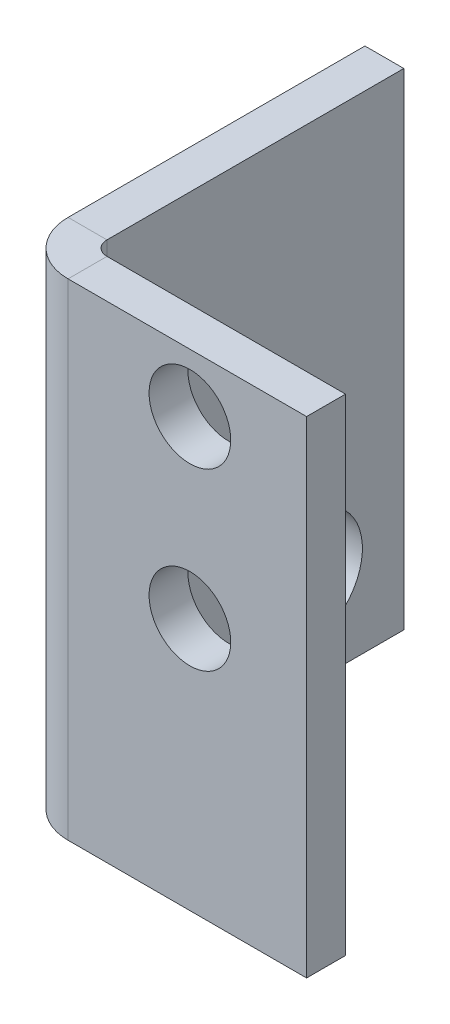
ISO-10303-21;
HEADER;
FILE_DESCRIPTION(('STEP AP214'),'2;1');
FILE_NAME('part.step','',(''),(''),'','','');
FILE_SCHEMA(('AUTOMOTIVE_DESIGN { 1 0 10303 214 1 1 1 1 }'));
ENDSEC;
DATA;
#1=APPLICATION_CONTEXT('core data for automotive mechanical design processes');
#2=APPLICATION_PROTOCOL_DEFINITION('international standard','automotive_design',2000,#1);
#3=PRODUCT_CONTEXT('',#1,'mechanical');
#4=PRODUCT('Part','Part','',(#3));
#5=PRODUCT_RELATED_PRODUCT_CATEGORY('part','',(#4));
#6=PRODUCT_DEFINITION_FORMATION('','',#4);
#7=PRODUCT_DEFINITION_CONTEXT('part definition',#1,'design');
#8=PRODUCT_DEFINITION('design','',#6,#7);
#9=PRODUCT_DEFINITION_SHAPE('','',#8);
#10=(LENGTH_UNIT() NAMED_UNIT(*) SI_UNIT(.MILLI.,.METRE.));
#11=(NAMED_UNIT(*) PLANE_ANGLE_UNIT() SI_UNIT($,.RADIAN.));
#12=(NAMED_UNIT(*) SI_UNIT($,.STERADIAN.) SOLID_ANGLE_UNIT());
#13=UNCERTAINTY_MEASURE_WITH_UNIT(LENGTH_MEASURE(1.E-05),#10,'distance_accuracy_value','');
#14=(GEOMETRIC_REPRESENTATION_CONTEXT(3) GLOBAL_UNCERTAINTY_ASSIGNED_CONTEXT((#13)) GLOBAL_UNIT_ASSIGNED_CONTEXT((#10,
#11,#12)) REPRESENTATION_CONTEXT('',''));
#15=CARTESIAN_POINT('',(0.,0.,0.));
#16=DIRECTION('',(0.,0.,1.));
#17=DIRECTION('',(1.,0.,0.));
#18=AXIS2_PLACEMENT_3D('',#15,#16,#17);
#19=CARTESIAN_POINT('',(2.,0.,22.));
#20=DIRECTION('',(-1.,0.,0.));
#21=DIRECTION('',(0.,0.,1.));
#22=AXIS2_PLACEMENT_3D('',#19,#20,#21);
#23=PLANE('',#22);
#24=CARTESIAN_POINT('',(2.,4.7,9.13));
#25=DIRECTION('',(-1.,0.,0.));
#26=DIRECTION('',(0.,0.,1.));
#27=AXIS2_PLACEMENT_3D('',#24,#25,#26);
#28=CIRCLE('',#27,3.);
#29=CARTESIAN_POINT('',(2.,4.7,12.13));
#30=VERTEX_POINT('',#29);
#31=EDGE_CURVE('E171',#30,#30,#28,.T.);
#32=ORIENTED_EDGE('',*,*,#31,.T.);
#33=EDGE_LOOP('',(#32));
#34=FACE_BOUND('',#33,.T.);
#35=DIRECTION('',(0.,-1.,0.));
#36=VECTOR('',#35,1.);
#37=CARTESIAN_POINT('',(2.,0.,4.));
#38=LINE('',#37,#36);
#39=CARTESIAN_POINT('',(2.,25.,4.));
#40=VERTEX_POINT('',#39);
#41=CARTESIAN_POINT('',(2.,0.,4.));
#42=VERTEX_POINT('',#41);
#43=EDGE_CURVE('E122',#40,#42,#38,.T.);
#44=ORIENTED_EDGE('',*,*,#43,.F.);
#45=DIRECTION('',(0.,0.,-1.));
#46=VECTOR('',#45,1.);
#47=CARTESIAN_POINT('',(2.,25.,22.));
#48=LINE('',#47,#46);
#49=CARTESIAN_POINT('',(2.,25.,19.2634));
#50=VERTEX_POINT('',#49);
#51=EDGE_CURVE('E65',#50,#40,#48,.T.);
#52=ORIENTED_EDGE('',*,*,#51,.F.);
#53=DIRECTION('',(0.,-1.,0.));
#54=VECTOR('',#53,1.);
#55=CARTESIAN_POINT('',(2.,0.,19.2634));
#56=LINE('',#55,#54);
#57=CARTESIAN_POINT('',(2.,0.,19.2634));
#58=VERTEX_POINT('',#57);
#59=EDGE_CURVE('E153',#58,#50,#56,.F.);
#60=ORIENTED_EDGE('',*,*,#59,.F.);
#61=DIRECTION('',(0.,0.,-1.));
#62=VECTOR('',#61,1.);
#63=CARTESIAN_POINT('',(2.,0.,22.));
#64=LINE('',#63,#62);
#65=EDGE_CURVE('E140',#58,#42,#64,.T.);
#66=ORIENTED_EDGE('',*,*,#65,.T.);
#67=EDGE_LOOP('',(#44,#52,#60,#66));
#68=FACE_BOUND('',#67,.T.);
#69=ADVANCED_FACE('F58',(#34,#68),#23,.F.);
#70=CARTESIAN_POINT('',(0.,0.,22.));
#71=DIRECTION('',(-1.,0.,0.));
#72=DIRECTION('',(0.,0.,1.));
#73=AXIS2_PLACEMENT_3D('',#70,#71,#72);
#74=PLANE('',#73);
#75=CARTESIAN_POINT('',(0.,4.7,9.13));
#76=DIRECTION('',(-1.,0.,0.));
#77=DIRECTION('',(0.,0.,1.));
#78=AXIS2_PLACEMENT_3D('',#75,#76,#77);
#79=CIRCLE('',#78,3.);
#80=CARTESIAN_POINT('',(0.,4.7,12.13));
#81=VERTEX_POINT('',#80);
#82=EDGE_CURVE('E168',#81,#81,#79,.T.);
#83=ORIENTED_EDGE('',*,*,#82,.F.);
#84=EDGE_LOOP('',(#83));
#85=FACE_BOUND('',#84,.T.);
#86=DIRECTION('',(0.,0.,-1.));
#87=VECTOR('',#86,1.);
#88=CARTESIAN_POINT('',(0.,25.,22.));
#89=LINE('',#88,#87);
#90=CARTESIAN_POINT('',(0.,25.,19.2634));
#91=VERTEX_POINT('',#90);
#92=CARTESIAN_POINT('',(0.,25.,4.));
#93=VERTEX_POINT('',#92);
#94=EDGE_CURVE('E135',#91,#93,#89,.T.);
#95=ORIENTED_EDGE('',*,*,#94,.T.);
#96=DIRECTION('',(0.,1.,0.));
#97=VECTOR('',#96,1.);
#98=CARTESIAN_POINT('',(0.,0.,4.));
#99=LINE('',#98,#97);
#100=CARTESIAN_POINT('',(0.,0.,4.));
#101=VERTEX_POINT('',#100);
#102=EDGE_CURVE('E72',#101,#93,#99,.T.);
#103=ORIENTED_EDGE('',*,*,#102,.F.);
#104=DIRECTION('',(0.,0.,-1.));
#105=VECTOR('',#104,1.);
#106=CARTESIAN_POINT('',(0.,0.,22.));
#107=LINE('',#106,#105);
#108=CARTESIAN_POINT('',(0.,0.,19.2634));
#109=VERTEX_POINT('',#108);
#110=EDGE_CURVE('E133',#109,#101,#107,.T.);
#111=ORIENTED_EDGE('',*,*,#110,.F.);
#112=DIRECTION('',(0.,-1.,0.));
#113=VECTOR('',#112,1.);
#114=CARTESIAN_POINT('',(0.,0.,19.2634));
#115=LINE('',#114,#113);
#116=EDGE_CURVE('E207',#109,#91,#115,.F.);
#117=ORIENTED_EDGE('',*,*,#116,.T.);
#118=EDGE_LOOP('',(#95,#103,#111,#117));
#119=FACE_BOUND('',#118,.T.);
#120=ADVANCED_FACE('F131',(#85,#119),#74,.T.);
#121=CARTESIAN_POINT('',(2.,0.,22.));
#122=DIRECTION('',(0.,-1.,0.));
#123=DIRECTION('',(0.,0.,-1.));
#124=AXIS2_PLACEMENT_3D('',#121,#122,#123);
#125=PLANE('',#124);
#126=ORIENTED_EDGE('',*,*,#110,.T.);
#127=DIRECTION('',(-1.,0.,0.));
#128=VECTOR('',#127,1.);
#129=CARTESIAN_POINT('',(0.,0.,4.));
#130=LINE('',#129,#128);
#131=EDGE_CURVE('E119',#42,#101,#130,.T.);
#132=ORIENTED_EDGE('',*,*,#131,.F.);
#133=ORIENTED_EDGE('',*,*,#65,.F.);
#134=DIRECTION('',(-1.,0.,0.));
#135=VECTOR('',#134,1.);
#136=CARTESIAN_POINT('',(2.,0.,19.2634));
#137=LINE('',#136,#135);
#138=EDGE_CURVE('E139',#58,#109,#137,.T.);
#139=ORIENTED_EDGE('',*,*,#138,.T.);
#140=EDGE_LOOP('',(#126,#132,#133,#139));
#141=FACE_BOUND('',#140,.T.);
#142=ADVANCED_FACE('F138',(#141),#125,.T.);
#143=CARTESIAN_POINT('',(0.,25.,22.));
#144=DIRECTION('',(0.,1.,0.));
#145=DIRECTION('',(0.,0.,1.));
#146=AXIS2_PLACEMENT_3D('',#143,#144,#145);
#147=PLANE('',#146);
#148=ORIENTED_EDGE('',*,*,#51,.T.);
#149=DIRECTION('',(-1.,0.,0.));
#150=VECTOR('',#149,1.);
#151=CARTESIAN_POINT('',(0.,25.,4.));
#152=LINE('',#151,#150);
#153=EDGE_CURVE('E13',#40,#93,#152,.T.);
#154=ORIENTED_EDGE('',*,*,#153,.T.);
#155=ORIENTED_EDGE('',*,*,#94,.F.);
#156=DIRECTION('',(-1.,0.,0.));
#157=VECTOR('',#156,1.);
#158=CARTESIAN_POINT('',(2.,25.,19.2634));
#159=LINE('',#158,#157);
#160=EDGE_CURVE('E143',#50,#91,#159,.T.);
#161=ORIENTED_EDGE('',*,*,#160,.F.);
#162=EDGE_LOOP('',(#148,#154,#155,#161));
#163=FACE_BOUND('',#162,.T.);
#164=ADVANCED_FACE('F150',(#163),#147,.T.);
#165=CARTESIAN_POINT('',(2.7366,25.,19.2634));
#166=DIRECTION('',(0.,1.,0.));
#167=DIRECTION('',(0.,0.,1.));
#168=AXIS2_PLACEMENT_3D('',#165,#166,#167);
#169=PLANE('',#168);
#170=DIRECTION('',(0.,0.,1.));
#171=VECTOR('',#170,1.);
#172=CARTESIAN_POINT('',(2.7366,25.,22.));
#173=LINE('',#172,#171);
#174=CARTESIAN_POINT('',(2.7366,25.,20.));
#175=VERTEX_POINT('',#174);
#176=CARTESIAN_POINT('',(2.73659999999999,25.,22.));
#177=VERTEX_POINT('',#176);
#178=EDGE_CURVE('E174',#175,#177,#173,.T.);
#179=ORIENTED_EDGE('',*,*,#178,.F.);
#180=CARTESIAN_POINT('',(2.7366,25.,19.2634));
#181=DIRECTION('',(0.,-1.,0.));
#182=DIRECTION('',(0.,0.,-1.));
#183=AXIS2_PLACEMENT_3D('',#180,#181,#182);
#184=CIRCLE('',#183,0.7366);
#185=EDGE_CURVE('E213',#50,#175,#184,.F.);
#186=ORIENTED_EDGE('',*,*,#185,.F.);
#187=ORIENTED_EDGE('',*,*,#160,.T.);
#188=CARTESIAN_POINT('',(2.7366,25.,19.2634));
#189=DIRECTION('',(0.,-1.,0.));
#190=DIRECTION('',(0.,0.,-1.));
#191=AXIS2_PLACEMENT_3D('',#188,#189,#190);
#192=CIRCLE('',#191,2.7366);
#193=EDGE_CURVE('E79',#91,#177,#192,.F.);
#194=ORIENTED_EDGE('',*,*,#193,.T.);
#195=EDGE_LOOP('',(#179,#186,#187,#194));
#196=FACE_BOUND('',#195,.T.);
#197=ADVANCED_FACE('F221',(#196),#169,.T.);
#198=CARTESIAN_POINT('',(2.7366,0.,19.2634));
#199=DIRECTION('',(0.,1.,0.));
#200=DIRECTION('',(0.,0.,1.));
#201=AXIS2_PLACEMENT_3D('',#198,#199,#200);
#202=PLANE('',#201);
#203=CARTESIAN_POINT('',(2.7366,0.,19.2634));
#204=DIRECTION('',(0.,-1.,0.));
#205=DIRECTION('',(0.,0.,-1.));
#206=AXIS2_PLACEMENT_3D('',#203,#204,#205);
#207=CIRCLE('',#206,0.7366);
#208=CARTESIAN_POINT('',(2.7366,0.,20.));
#209=VERTEX_POINT('',#208);
#210=EDGE_CURVE('E177',#209,#58,#207,.T.);
#211=ORIENTED_EDGE('',*,*,#210,.F.);
#212=DIRECTION('',(0.,0.,1.));
#213=VECTOR('',#212,1.);
#214=CARTESIAN_POINT('',(2.7366,0.,20.));
#215=LINE('',#214,#213);
#216=CARTESIAN_POINT('',(2.7366,0.,22.));
#217=VERTEX_POINT('',#216);
#218=EDGE_CURVE('E200',#209,#217,#215,.T.);
#219=ORIENTED_EDGE('',*,*,#218,.T.);
#220=CARTESIAN_POINT('',(2.7366,0.,19.2634));
#221=DIRECTION('',(0.,-1.,0.));
#222=DIRECTION('',(0.,0.,-1.));
#223=AXIS2_PLACEMENT_3D('',#220,#221,#222);
#224=CIRCLE('',#223,2.7366);
#225=EDGE_CURVE('E209',#217,#109,#224,.T.);
#226=ORIENTED_EDGE('',*,*,#225,.T.);
#227=ORIENTED_EDGE('',*,*,#138,.F.);
#228=EDGE_LOOP('',(#211,#219,#226,#227));
#229=FACE_BOUND('',#228,.T.);
#230=ADVANCED_FACE('F225',(#229),#202,.F.);
#231=CARTESIAN_POINT('',(2.7366,0.,19.2634));
#232=DIRECTION('',(0.,-1.,0.));
#233=DIRECTION('',(0.,0.,1.));
#234=AXIS2_PLACEMENT_3D('',#231,#232,#233);
#235=CYLINDRICAL_SURFACE('',#234,2.7366);
#236=ORIENTED_EDGE('',*,*,#116,.F.);
#237=ORIENTED_EDGE('',*,*,#225,.F.);
#238=DIRECTION('',(0.,-1.,0.));
#239=VECTOR('',#238,1.);
#240=CARTESIAN_POINT('',(2.7366,0.,22.));
#241=LINE('',#240,#239);
#242=EDGE_CURVE('E197',#177,#217,#241,.T.);
#243=ORIENTED_EDGE('',*,*,#242,.F.);
#244=ORIENTED_EDGE('',*,*,#193,.F.);
#245=EDGE_LOOP('',(#236,#237,#243,#244));
#246=FACE_BOUND('',#245,.T.);
#247=ADVANCED_FACE('F222',(#246),#235,.T.);
#248=CARTESIAN_POINT('',(2.7366,0.,19.2634));
#249=DIRECTION('',(0.,-1.,0.));
#250=DIRECTION('',(0.,0.,1.));
#251=AXIS2_PLACEMENT_3D('',#248,#249,#250);
#252=CYLINDRICAL_SURFACE('',#251,0.7366);
#253=ORIENTED_EDGE('',*,*,#59,.T.);
#254=ORIENTED_EDGE('',*,*,#185,.T.);
#255=DIRECTION('',(0.,1.,0.));
#256=VECTOR('',#255,1.);
#257=CARTESIAN_POINT('',(2.7366,25.,20.));
#258=LINE('',#257,#256);
#259=EDGE_CURVE('E203',#175,#209,#258,.F.);
#260=ORIENTED_EDGE('',*,*,#259,.T.);
#261=ORIENTED_EDGE('',*,*,#210,.T.);
#262=EDGE_LOOP('',(#253,#254,#260,#261));
#263=FACE_BOUND('',#262,.T.);
#264=ADVANCED_FACE('F244',(#263),#252,.F.);
#265=CARTESIAN_POINT('',(1.99999999999999,0.,22.));
#266=DIRECTION('',(0.,-1.,0.));
#267=DIRECTION('',(0.,0.,-1.));
#268=AXIS2_PLACEMENT_3D('',#265,#266,#267);
#269=PLANE('',#268);
#270=DIRECTION('',(-1.,0.,0.));
#271=VECTOR('',#270,1.);
#272=CARTESIAN_POINT('',(1.99999999999999,0.,22.));
#273=LINE('',#272,#271);
#274=CARTESIAN_POINT('',(15.,0.,22.));
#275=VERTEX_POINT('',#274);
#276=EDGE_CURVE('E181',#275,#217,#273,.T.);
#277=ORIENTED_EDGE('',*,*,#276,.T.);
#278=ORIENTED_EDGE('',*,*,#218,.F.);
#279=DIRECTION('',(1.,0.,0.));
#280=VECTOR('',#279,1.);
#281=CARTESIAN_POINT('',(0.,0.,20.));
#282=LINE('',#281,#280);
#283=CARTESIAN_POINT('',(15.,0.,20.));
#284=VERTEX_POINT('',#283);
#285=EDGE_CURVE('E189',#284,#209,#282,.F.);
#286=ORIENTED_EDGE('',*,*,#285,.F.);
#287=DIRECTION('',(0.,0.,-1.));
#288=VECTOR('',#287,1.);
#289=CARTESIAN_POINT('',(15.,0.,22.));
#290=LINE('',#289,#288);
#291=EDGE_CURVE('E175',#275,#284,#290,.T.);
#292=ORIENTED_EDGE('',*,*,#291,.F.);
#293=EDGE_LOOP('',(#277,#278,#286,#292));
#294=FACE_BOUND('',#293,.T.);
#295=ADVANCED_FACE('F234',(#294),#269,.T.);
#296=CARTESIAN_POINT('',(15.,25.,22.));
#297=DIRECTION('',(0.,1.,0.));
#298=DIRECTION('',(0.,0.,1.));
#299=AXIS2_PLACEMENT_3D('',#296,#297,#298);
#300=PLANE('',#299);
#301=DIRECTION('',(-1.,0.,0.));
#302=VECTOR('',#301,1.);
#303=CARTESIAN_POINT('',(0.,25.,20.));
#304=LINE('',#303,#302);
#305=CARTESIAN_POINT('',(15.,25.,20.));
#306=VERTEX_POINT('',#305);
#307=EDGE_CURVE('E195',#175,#306,#304,.F.);
#308=ORIENTED_EDGE('',*,*,#307,.F.);
#309=ORIENTED_EDGE('',*,*,#178,.T.);
#310=DIRECTION('',(1.,0.,0.));
#311=VECTOR('',#310,1.);
#312=CARTESIAN_POINT('',(15.,25.,22.));
#313=LINE('',#312,#311);
#314=CARTESIAN_POINT('',(15.,25.,22.));
#315=VERTEX_POINT('',#314);
#316=EDGE_CURVE('E187',#177,#315,#313,.T.);
#317=ORIENTED_EDGE('',*,*,#316,.T.);
#318=DIRECTION('',(0.,0.,-1.));
#319=VECTOR('',#318,1.);
#320=CARTESIAN_POINT('',(15.,25.,22.));
#321=LINE('',#320,#319);
#322=EDGE_CURVE('E178',#315,#306,#321,.T.);
#323=ORIENTED_EDGE('',*,*,#322,.T.);
#324=EDGE_LOOP('',(#308,#309,#317,#323));
#325=FACE_BOUND('',#324,.T.);
#326=ADVANCED_FACE('F241',(#325),#300,.T.);
#327=CARTESIAN_POINT('',(0.,0.,22.));
#328=DIRECTION('',(0.,0.,1.));
#329=DIRECTION('',(1.,0.,0.));
#330=AXIS2_PLACEMENT_3D('',#327,#328,#329);
#331=PLANE('',#330);
#332=CARTESIAN_POINT('',(9.,22.,22.));
#333=DIRECTION('',(0.,0.,1.));
#334=DIRECTION('',(1.,0.,0.));
#335=AXIS2_PLACEMENT_3D('',#332,#333,#334);
#336=CIRCLE('',#335,2.1);
#337=CARTESIAN_POINT('',(11.1,22.,22.));
#338=VERTEX_POINT('',#337);
#339=EDGE_CURVE('E157',#338,#338,#336,.T.);
#340=ORIENTED_EDGE('',*,*,#339,.F.);
#341=EDGE_LOOP('',(#340));
#342=FACE_BOUND('',#341,.T.);
#343=CARTESIAN_POINT('',(9.,13.,22.));
#344=DIRECTION('',(0.,0.,1.));
#345=DIRECTION('',(1.,0.,0.));
#346=AXIS2_PLACEMENT_3D('',#343,#344,#345);
#347=CIRCLE('',#346,2.1);
#348=CARTESIAN_POINT('',(11.1,13.,22.));
#349=VERTEX_POINT('',#348);
#350=EDGE_CURVE('E165',#349,#349,#347,.T.);
#351=ORIENTED_EDGE('',*,*,#350,.F.);
#352=EDGE_LOOP('',(#351));
#353=FACE_BOUND('',#352,.T.);
#354=ORIENTED_EDGE('',*,*,#316,.F.);
#355=ORIENTED_EDGE('',*,*,#242,.T.);
#356=ORIENTED_EDGE('',*,*,#276,.F.);
#357=DIRECTION('',(0.,-1.,0.));
#358=VECTOR('',#357,1.);
#359=CARTESIAN_POINT('',(15.,0.,22.));
#360=LINE('',#359,#358);
#361=EDGE_CURVE('E184',#315,#275,#360,.T.);
#362=ORIENTED_EDGE('',*,*,#361,.F.);
#363=EDGE_LOOP('',(#354,#355,#356,#362));
#364=FACE_BOUND('',#363,.T.);
#365=ADVANCED_FACE('F232',(#342,#353,#364),#331,.T.);
#366=CARTESIAN_POINT('',(0.,0.,20.));
#367=DIRECTION('',(0.,0.,1.));
#368=DIRECTION('',(1.,0.,0.));
#369=AXIS2_PLACEMENT_3D('',#366,#367,#368);
#370=PLANE('',#369);
#371=CARTESIAN_POINT('',(9.00000000000001,22.,20.));
#372=DIRECTION('',(0.,0.,-1.));
#373=DIRECTION('',(-1.,0.,0.));
#374=AXIS2_PLACEMENT_3D('',#371,#372,#373);
#375=CIRCLE('',#374,2.1);
#376=CARTESIAN_POINT('',(6.9,22.,20.));
#377=VERTEX_POINT('',#376);
#378=EDGE_CURVE('E154',#377,#377,#375,.T.);
#379=ORIENTED_EDGE('',*,*,#378,.F.);
#380=EDGE_LOOP('',(#379));
#381=FACE_BOUND('',#380,.T.);
#382=CARTESIAN_POINT('',(9.00000000000001,13.,20.));
#383=DIRECTION('',(0.,0.,-1.));
#384=DIRECTION('',(-1.,0.,0.));
#385=AXIS2_PLACEMENT_3D('',#382,#383,#384);
#386=CIRCLE('',#385,2.1);
#387=CARTESIAN_POINT('',(6.9,13.,20.));
#388=VERTEX_POINT('',#387);
#389=EDGE_CURVE('E162',#388,#388,#386,.T.);
#390=ORIENTED_EDGE('',*,*,#389,.F.);
#391=EDGE_LOOP('',(#390));
#392=FACE_BOUND('',#391,.T.);
#393=ORIENTED_EDGE('',*,*,#259,.F.);
#394=ORIENTED_EDGE('',*,*,#307,.T.);
#395=DIRECTION('',(0.,1.,0.));
#396=VECTOR('',#395,1.);
#397=CARTESIAN_POINT('',(15.,0.,20.));
#398=LINE('',#397,#396);
#399=EDGE_CURVE('E192',#306,#284,#398,.F.);
#400=ORIENTED_EDGE('',*,*,#399,.T.);
#401=ORIENTED_EDGE('',*,*,#285,.T.);
#402=EDGE_LOOP('',(#393,#394,#400,#401));
#403=FACE_BOUND('',#402,.T.);
#404=ADVANCED_FACE('F246',(#381,#392,#403),#370,.F.);
#405=CARTESIAN_POINT('',(15.,0.,22.));
#406=DIRECTION('',(1.,0.,0.));
#407=DIRECTION('',(0.,0.,-1.));
#408=AXIS2_PLACEMENT_3D('',#405,#406,#407);
#409=PLANE('',#408);
#410=ORIENTED_EDGE('',*,*,#399,.F.);
#411=ORIENTED_EDGE('',*,*,#322,.F.);
#412=ORIENTED_EDGE('',*,*,#361,.T.);
#413=ORIENTED_EDGE('',*,*,#291,.T.);
#414=EDGE_LOOP('',(#410,#411,#412,#413));
#415=FACE_BOUND('',#414,.T.);
#416=ADVANCED_FACE('F238',(#415),#409,.T.);
#417=CARTESIAN_POINT('',(10.,4.7,9.13));
#418=DIRECTION('',(-1.,0.,0.));
#419=DIRECTION('',(0.,0.,1.));
#420=AXIS2_PLACEMENT_3D('',#417,#418,#419);
#421=CYLINDRICAL_SURFACE('',#420,3.);
#422=ORIENTED_EDGE('',*,*,#82,.T.);
#423=EDGE_LOOP('',(#422));
#424=FACE_BOUND('',#423,.T.);
#425=ORIENTED_EDGE('',*,*,#31,.F.);
#426=EDGE_LOOP('',(#425));
#427=FACE_BOUND('',#426,.T.);
#428=ADVANCED_FACE('F254',(#424,#427),#421,.F.);
#429=CARTESIAN_POINT('',(8.99999999999997,13.,30.));
#430=DIRECTION('',(0.,0.,-1.));
#431=DIRECTION('',(-1.,0.,0.));
#432=AXIS2_PLACEMENT_3D('',#429,#430,#431);
#433=CYLINDRICAL_SURFACE('',#432,2.1);
#434=ORIENTED_EDGE('',*,*,#350,.T.);
#435=EDGE_LOOP('',(#434));
#436=FACE_BOUND('',#435,.T.);
#437=ORIENTED_EDGE('',*,*,#389,.T.);
#438=EDGE_LOOP('',(#437));
#439=FACE_BOUND('',#438,.T.);
#440=ADVANCED_FACE('F272',(#436,#439),#433,.F.);
#441=CARTESIAN_POINT('',(8.99999999999997,22.,30.));
#442=DIRECTION('',(0.,0.,-1.));
#443=DIRECTION('',(-1.,0.,0.));
#444=AXIS2_PLACEMENT_3D('',#441,#442,#443);
#445=CYLINDRICAL_SURFACE('',#444,2.1);
#446=ORIENTED_EDGE('',*,*,#339,.T.);
#447=EDGE_LOOP('',(#446));
#448=FACE_BOUND('',#447,.T.);
#449=ORIENTED_EDGE('',*,*,#378,.T.);
#450=EDGE_LOOP('',(#449));
#451=FACE_BOUND('',#450,.T.);
#452=ADVANCED_FACE('F278',(#448,#451),#445,.F.);
#453=CARTESIAN_POINT('',(0.,0.,4.));
#454=DIRECTION('',(0.,0.,-1.));
#455=DIRECTION('',(-1.,0.,0.));
#456=AXIS2_PLACEMENT_3D('',#453,#454,#455);
#457=PLANE('',#456);
#458=ORIENTED_EDGE('',*,*,#43,.T.);
#459=ORIENTED_EDGE('',*,*,#131,.T.);
#460=ORIENTED_EDGE('',*,*,#102,.T.);
#461=ORIENTED_EDGE('',*,*,#153,.F.);
#462=EDGE_LOOP('',(#458,#459,#460,#461));
#463=FACE_BOUND('',#462,.T.);
#464=ADVANCED_FACE('F120',(#463),#457,.T.);
#465=CLOSED_SHELL('',(#69,#120,#142,#164,#197,#230,#247,#264,#295,#326,#365,#404,#416,#428,#440,
#452,#464));
#466=MANIFOLD_SOLID_BREP('B2',#465);
#467=ADVANCED_BREP_SHAPE_REPRESENTATION('',(#18,#466),#14);
#468=SHAPE_DEFINITION_REPRESENTATION(#9,#467);
ENDSEC;
END-ISO-10303-21;
